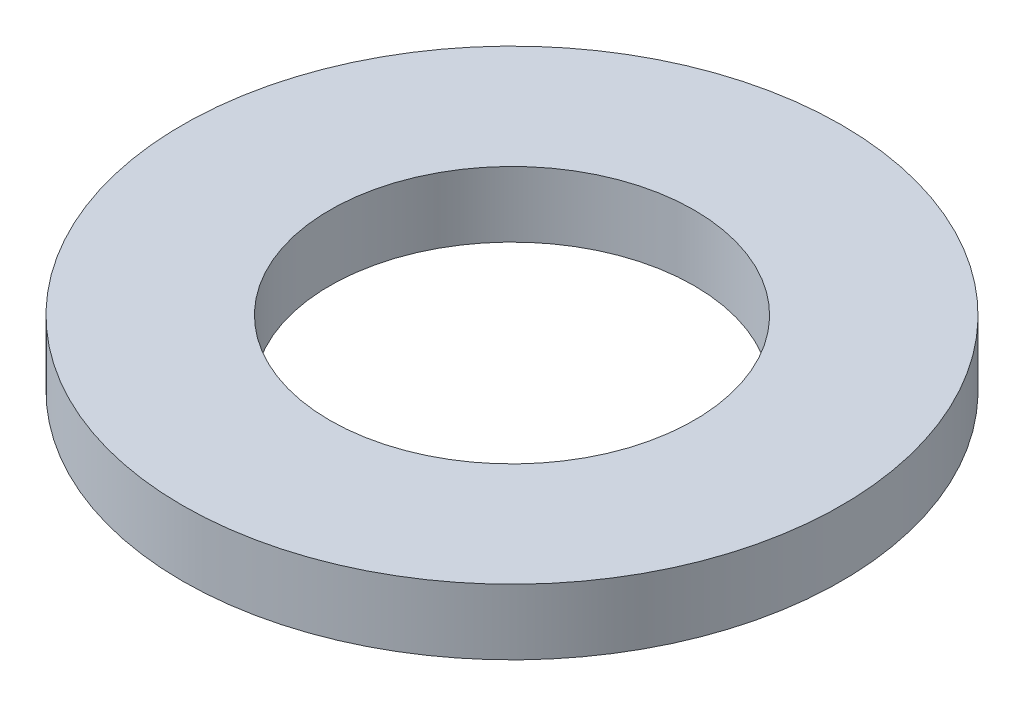
ISO-10303-21;
HEADER;
FILE_DESCRIPTION(('STEP AP214'),'2;1');
FILE_NAME('part.step','',(''),(''),'','','');
FILE_SCHEMA(('AUTOMOTIVE_DESIGN { 1 0 10303 214 1 1 1 1 }'));
ENDSEC;
DATA;
#1=APPLICATION_CONTEXT('core data for automotive mechanical design processes');
#2=APPLICATION_PROTOCOL_DEFINITION('international standard','automotive_design',2000,#1);
#3=PRODUCT_CONTEXT('',#1,'mechanical');
#4=PRODUCT('Part','Part','',(#3));
#5=PRODUCT_RELATED_PRODUCT_CATEGORY('part','',(#4));
#6=PRODUCT_DEFINITION_FORMATION('','',#4);
#7=PRODUCT_DEFINITION_CONTEXT('part definition',#1,'design');
#8=PRODUCT_DEFINITION('design','',#6,#7);
#9=PRODUCT_DEFINITION_SHAPE('','',#8);
#10=(LENGTH_UNIT() NAMED_UNIT(*) SI_UNIT(.MILLI.,.METRE.));
#11=(NAMED_UNIT(*) PLANE_ANGLE_UNIT() SI_UNIT($,.RADIAN.));
#12=(NAMED_UNIT(*) SI_UNIT($,.STERADIAN.) SOLID_ANGLE_UNIT());
#13=UNCERTAINTY_MEASURE_WITH_UNIT(LENGTH_MEASURE(1.E-05),#10,'distance_accuracy_value','');
#14=(GEOMETRIC_REPRESENTATION_CONTEXT(3) GLOBAL_UNCERTAINTY_ASSIGNED_CONTEXT((#13)) GLOBAL_UNIT_ASSIGNED_CONTEXT((#10,
#11,#12)) REPRESENTATION_CONTEXT('',''));
#15=CARTESIAN_POINT('',(0.,0.,0.));
#16=DIRECTION('',(0.,0.,1.));
#17=DIRECTION('',(1.,0.,0.));
#18=AXIS2_PLACEMENT_3D('',#15,#16,#17);
#19=CARTESIAN_POINT('',(0.,3.7084,0.));
#20=DIRECTION('',(0.,-1.,0.));
#21=DIRECTION('',(0.,0.,-1.));
#22=AXIS2_PLACEMENT_3D('',#19,#20,#21);
#23=CYLINDRICAL_SURFACE('',#22,18.6563);
#24=CARTESIAN_POINT('',(0.,3.7084,0.));
#25=DIRECTION('',(0.,1.,0.));
#26=DIRECTION('',(0.,0.,1.));
#27=AXIS2_PLACEMENT_3D('',#24,#25,#26);
#28=CIRCLE('',#27,18.6563);
#29=CARTESIAN_POINT('',(0.,3.7084,18.6563));
#30=VERTEX_POINT('',#29);
#31=EDGE_CURVE('E10',#30,#30,#28,.T.);
#32=ORIENTED_EDGE('',*,*,#31,.F.);
#33=EDGE_LOOP('',(#32));
#34=FACE_BOUND('',#33,.T.);
#35=CARTESIAN_POINT('',(0.,0.,0.));
#36=DIRECTION('',(0.,1.,0.));
#37=DIRECTION('',(0.,0.,1.));
#38=AXIS2_PLACEMENT_3D('',#35,#36,#37);
#39=CIRCLE('',#38,18.6563);
#40=CARTESIAN_POINT('',(0.,0.,18.6563));
#41=VERTEX_POINT('',#40);
#42=EDGE_CURVE('E39',#41,#41,#39,.T.);
#43=ORIENTED_EDGE('',*,*,#42,.T.);
#44=EDGE_LOOP('',(#43));
#45=FACE_BOUND('',#44,.T.);
#46=ADVANCED_FACE('F36',(#34,#45),#23,.T.);
#47=CARTESIAN_POINT('',(0.,3.7084,0.));
#48=DIRECTION('',(0.,1.,0.));
#49=DIRECTION('',(0.,0.,1.));
#50=AXIS2_PLACEMENT_3D('',#47,#48,#49);
#51=PLANE('',#50);
#52=CARTESIAN_POINT('',(0.,3.7084,0.));
#53=DIRECTION('',(0.,1.,0.));
#54=DIRECTION('',(0.,0.,1.));
#55=AXIS2_PLACEMENT_3D('',#52,#53,#54);
#56=CIRCLE('',#55,10.3124);
#57=CARTESIAN_POINT('',(0.,3.7084,10.3124));
#58=VERTEX_POINT('',#57);
#59=EDGE_CURVE('E50',#58,#58,#56,.T.);
#60=ORIENTED_EDGE('',*,*,#59,.F.);
#61=EDGE_LOOP('',(#60));
#62=FACE_BOUND('',#61,.T.);
#63=ORIENTED_EDGE('',*,*,#31,.T.);
#64=EDGE_LOOP('',(#63));
#65=FACE_BOUND('',#64,.T.);
#66=ADVANCED_FACE('F67',(#62,#65),#51,.T.);
#67=CARTESIAN_POINT('',(0.,0.,0.));
#68=DIRECTION('',(0.,1.,0.));
#69=DIRECTION('',(0.,0.,1.));
#70=AXIS2_PLACEMENT_3D('',#67,#68,#69);
#71=PLANE('',#70);
#72=CARTESIAN_POINT('',(0.,0.,0.));
#73=DIRECTION('',(0.,1.,0.));
#74=DIRECTION('',(0.,0.,1.));
#75=AXIS2_PLACEMENT_3D('',#72,#73,#74);
#76=CIRCLE('',#75,10.3124);
#77=CARTESIAN_POINT('',(0.,0.,10.3124));
#78=VERTEX_POINT('',#77);
#79=EDGE_CURVE('E48',#78,#78,#76,.T.);
#80=ORIENTED_EDGE('',*,*,#79,.T.);
#81=EDGE_LOOP('',(#80));
#82=FACE_BOUND('',#81,.T.);
#83=ORIENTED_EDGE('',*,*,#42,.F.);
#84=EDGE_LOOP('',(#83));
#85=FACE_BOUND('',#84,.T.);
#86=ADVANCED_FACE('F58',(#82,#85),#71,.F.);
#87=CARTESIAN_POINT('',(0.,0.,0.));
#88=DIRECTION('',(0.,1.,0.));
#89=DIRECTION('',(0.,0.,1.));
#90=AXIS2_PLACEMENT_3D('',#87,#88,#89);
#91=CYLINDRICAL_SURFACE('',#90,10.3124);
#92=ORIENTED_EDGE('',*,*,#79,.F.);
#93=EDGE_LOOP('',(#92));
#94=FACE_BOUND('',#93,.T.);
#95=ORIENTED_EDGE('',*,*,#59,.T.);
#96=EDGE_LOOP('',(#95));
#97=FACE_BOUND('',#96,.T.);
#98=ADVANCED_FACE('F61',(#94,#97),#91,.F.);
#99=CLOSED_SHELL('',(#46,#66,#86,#98));
#100=MANIFOLD_SOLID_BREP('B2',#99);
#101=ADVANCED_BREP_SHAPE_REPRESENTATION('',(#18,#100),#14);
#102=SHAPE_DEFINITION_REPRESENTATION(#9,#101);
ENDSEC;
END-ISO-10303-21;
